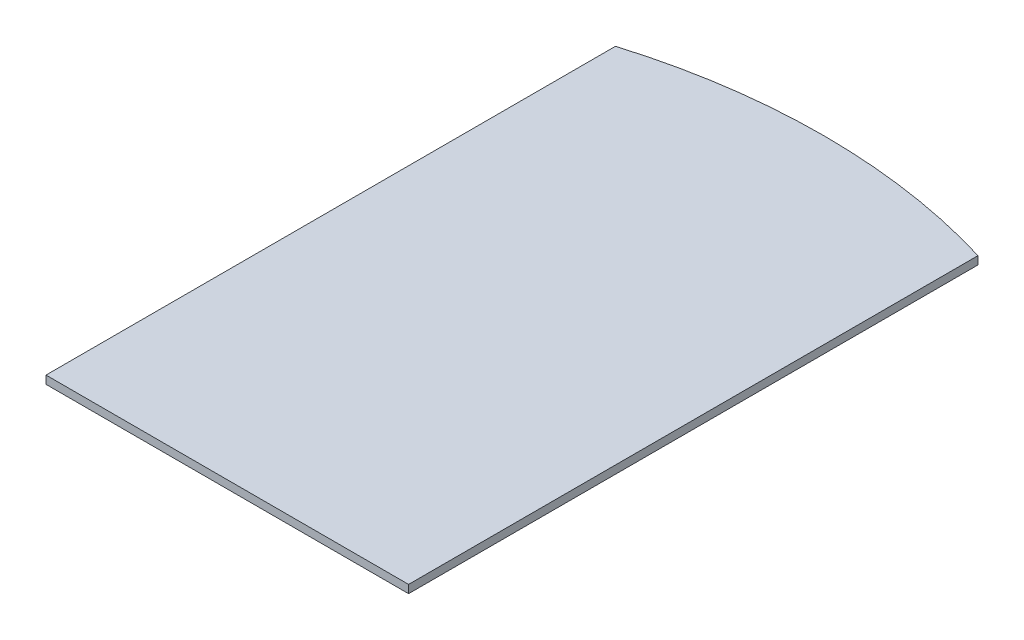
ISO-10303-21;
HEADER;
FILE_DESCRIPTION(('STEP AP214'),'2;1');
FILE_NAME('part.step','',(''),(''),'','','');
FILE_SCHEMA(('AUTOMOTIVE_DESIGN { 1 0 10303 214 1 1 1 1 }'));
ENDSEC;
DATA;
#1=APPLICATION_CONTEXT('core data for automotive mechanical design processes');
#2=APPLICATION_PROTOCOL_DEFINITION('international standard','automotive_design',2000,#1);
#3=PRODUCT_CONTEXT('',#1,'mechanical');
#4=PRODUCT('Part','Part','',(#3));
#5=PRODUCT_RELATED_PRODUCT_CATEGORY('part','',(#4));
#6=PRODUCT_DEFINITION_FORMATION('','',#4);
#7=PRODUCT_DEFINITION_CONTEXT('part definition',#1,'design');
#8=PRODUCT_DEFINITION('design','',#6,#7);
#9=PRODUCT_DEFINITION_SHAPE('','',#8);
#10=(LENGTH_UNIT() NAMED_UNIT(*) SI_UNIT(.MILLI.,.METRE.));
#11=(NAMED_UNIT(*) PLANE_ANGLE_UNIT() SI_UNIT($,.RADIAN.));
#12=(NAMED_UNIT(*) SI_UNIT($,.STERADIAN.) SOLID_ANGLE_UNIT());
#13=UNCERTAINTY_MEASURE_WITH_UNIT(LENGTH_MEASURE(1.E-05),#10,'distance_accuracy_value','');
#14=(GEOMETRIC_REPRESENTATION_CONTEXT(3) GLOBAL_UNCERTAINTY_ASSIGNED_CONTEXT((#13)) GLOBAL_UNIT_ASSIGNED_CONTEXT((#10,
#11,#12)) REPRESENTATION_CONTEXT('',''));
#15=CARTESIAN_POINT('',(0.,0.,0.));
#16=DIRECTION('',(0.,0.,1.));
#17=DIRECTION('',(1.,0.,0.));
#18=AXIS2_PLACEMENT_3D('',#15,#16,#17);
#19=CARTESIAN_POINT('',(225.,-10.,370.));
#20=DIRECTION('',(1.,0.,0.));
#21=DIRECTION('',(0.,0.,-1.));
#22=AXIS2_PLACEMENT_3D('',#19,#20,#21);
#23=PLANE('',#22);
#24=DIRECTION('',(0.,0.,-1.));
#25=VECTOR('',#24,1.);
#26=CARTESIAN_POINT('',(225.,0.,370.));
#27=LINE('',#26,#25);
#28=CARTESIAN_POINT('',(225.,0.,370.));
#29=VERTEX_POINT('',#28);
#30=CARTESIAN_POINT('',(225.,0.,-336.709620752616));
#31=VERTEX_POINT('',#30);
#32=EDGE_CURVE('E100',#29,#31,#27,.T.);
#33=ORIENTED_EDGE('',*,*,#32,.F.);
#34=DIRECTION('',(0.,1.,0.));
#35=VECTOR('',#34,1.);
#36=CARTESIAN_POINT('',(225.,-10.,370.));
#37=LINE('',#36,#35);
#38=CARTESIAN_POINT('',(225.,-10.,370.));
#39=VERTEX_POINT('',#38);
#40=EDGE_CURVE('E11',#39,#29,#37,.T.);
#41=ORIENTED_EDGE('',*,*,#40,.F.);
#42=DIRECTION('',(0.,0.,-1.));
#43=VECTOR('',#42,1.);
#44=CARTESIAN_POINT('',(225.,-10.,370.));
#45=LINE('',#44,#43);
#46=CARTESIAN_POINT('',(225.,-10.,-336.709620752616));
#47=VERTEX_POINT('',#46);
#48=EDGE_CURVE('E94',#39,#47,#45,.T.);
#49=ORIENTED_EDGE('',*,*,#48,.T.);
#50=DIRECTION('',(0.,1.,0.));
#51=VECTOR('',#50,1.);
#52=CARTESIAN_POINT('',(225.,-10.,-336.709620752616));
#53=LINE('',#52,#51);
#54=EDGE_CURVE('E39',#47,#31,#53,.T.);
#55=ORIENTED_EDGE('',*,*,#54,.T.);
#56=EDGE_LOOP('',(#33,#41,#49,#55));
#57=FACE_BOUND('',#56,.T.);
#58=ADVANCED_FACE('F36',(#57),#23,.T.);
#59=CARTESIAN_POINT('',(225.,-10.,370.));
#60=DIRECTION('',(0.,0.,1.));
#61=DIRECTION('',(1.,0.,0.));
#62=AXIS2_PLACEMENT_3D('',#59,#60,#61);
#63=PLANE('',#62);
#64=DIRECTION('',(1.,0.,0.));
#65=VECTOR('',#64,1.);
#66=CARTESIAN_POINT('',(225.,0.,370.));
#67=LINE('',#66,#65);
#68=CARTESIAN_POINT('',(-225.,0.,370.));
#69=VERTEX_POINT('',#68);
#70=EDGE_CURVE('E96',#69,#29,#67,.T.);
#71=ORIENTED_EDGE('',*,*,#70,.F.);
#72=DIRECTION('',(0.,1.,0.));
#73=VECTOR('',#72,1.);
#74=CARTESIAN_POINT('',(-225.,-10.,370.));
#75=LINE('',#74,#73);
#76=CARTESIAN_POINT('',(-225.,-10.,370.));
#77=VERTEX_POINT('',#76);
#78=EDGE_CURVE('E45',#77,#69,#75,.T.);
#79=ORIENTED_EDGE('',*,*,#78,.F.);
#80=DIRECTION('',(1.,0.,0.));
#81=VECTOR('',#80,1.);
#82=CARTESIAN_POINT('',(225.,-10.,370.));
#83=LINE('',#82,#81);
#84=EDGE_CURVE('E91',#77,#39,#83,.T.);
#85=ORIENTED_EDGE('',*,*,#84,.T.);
#86=ORIENTED_EDGE('',*,*,#40,.T.);
#87=EDGE_LOOP('',(#71,#79,#85,#86));
#88=FACE_BOUND('',#87,.T.);
#89=ADVANCED_FACE('F110',(#88),#63,.T.);
#90=CARTESIAN_POINT('',(-225.,-10.,370.));
#91=DIRECTION('',(-1.,0.,0.));
#92=DIRECTION('',(0.,0.,1.));
#93=AXIS2_PLACEMENT_3D('',#90,#91,#92);
#94=PLANE('',#93);
#95=DIRECTION('',(0.,0.,1.));
#96=VECTOR('',#95,1.);
#97=CARTESIAN_POINT('',(-225.,0.,370.));
#98=LINE('',#97,#96);
#99=CARTESIAN_POINT('',(-225.,0.,-336.709620752616));
#100=VERTEX_POINT('',#99);
#101=EDGE_CURVE('E86',#100,#69,#98,.T.);
#102=ORIENTED_EDGE('',*,*,#101,.F.);
#103=DIRECTION('',(0.,1.,0.));
#104=VECTOR('',#103,1.);
#105=CARTESIAN_POINT('',(-225.,-10.,-336.709620752616));
#106=LINE('',#105,#104);
#107=CARTESIAN_POINT('',(-225.,-10.,-336.709620752616));
#108=VERTEX_POINT('',#107);
#109=EDGE_CURVE('E81',#108,#100,#106,.T.);
#110=ORIENTED_EDGE('',*,*,#109,.F.);
#111=DIRECTION('',(0.,0.,1.));
#112=VECTOR('',#111,1.);
#113=CARTESIAN_POINT('',(-225.,-10.,370.));
#114=LINE('',#113,#112);
#115=EDGE_CURVE('E84',#108,#77,#114,.T.);
#116=ORIENTED_EDGE('',*,*,#115,.T.);
#117=ORIENTED_EDGE('',*,*,#78,.T.);
#118=EDGE_LOOP('',(#102,#110,#116,#117));
#119=FACE_BOUND('',#118,.T.);
#120=ADVANCED_FACE('F83',(#119),#94,.T.);
#121=CARTESIAN_POINT('',(0.,-10.,407.));
#122=DIRECTION('',(0.,1.,0.));
#123=DIRECTION('',(0.,0.,1.));
#124=AXIS2_PLACEMENT_3D('',#121,#122,#123);
#125=CYLINDRICAL_SURFACE('',#124,777.);
#126=CARTESIAN_POINT('',(0.,0.,407.));
#127=DIRECTION('',(0.,1.,0.));
#128=DIRECTION('',(0.,0.,1.));
#129=AXIS2_PLACEMENT_3D('',#126,#127,#128);
#130=CIRCLE('',#129,777.);
#131=EDGE_CURVE('E103',#31,#100,#130,.T.);
#132=ORIENTED_EDGE('',*,*,#131,.F.);
#133=ORIENTED_EDGE('',*,*,#54,.F.);
#134=CARTESIAN_POINT('',(0.,-10.,407.));
#135=DIRECTION('',(0.,1.,0.));
#136=DIRECTION('',(0.,0.,1.));
#137=AXIS2_PLACEMENT_3D('',#134,#135,#136);
#138=CIRCLE('',#137,777.);
#139=EDGE_CURVE('E90',#47,#108,#138,.T.);
#140=ORIENTED_EDGE('',*,*,#139,.T.);
#141=ORIENTED_EDGE('',*,*,#109,.T.);
#142=EDGE_LOOP('',(#132,#133,#140,#141));
#143=FACE_BOUND('',#142,.T.);
#144=ADVANCED_FACE('F93',(#143),#125,.T.);
#145=CARTESIAN_POINT('',(0.,-10.,407.));
#146=DIRECTION('',(0.,1.,0.));
#147=DIRECTION('',(0.,0.,1.));
#148=AXIS2_PLACEMENT_3D('',#145,#146,#147);
#149=PLANE('',#148);
#150=ORIENTED_EDGE('',*,*,#48,.F.);
#151=ORIENTED_EDGE('',*,*,#84,.F.);
#152=ORIENTED_EDGE('',*,*,#115,.F.);
#153=ORIENTED_EDGE('',*,*,#139,.F.);
#154=EDGE_LOOP('',(#150,#151,#152,#153));
#155=FACE_BOUND('',#154,.T.);
#156=ADVANCED_FACE('F89',(#155),#149,.F.);
#157=CARTESIAN_POINT('',(0.,0.,407.));
#158=DIRECTION('',(0.,1.,0.));
#159=DIRECTION('',(0.,0.,1.));
#160=AXIS2_PLACEMENT_3D('',#157,#158,#159);
#161=PLANE('',#160);
#162=ORIENTED_EDGE('',*,*,#32,.T.);
#163=ORIENTED_EDGE('',*,*,#131,.T.);
#164=ORIENTED_EDGE('',*,*,#101,.T.);
#165=ORIENTED_EDGE('',*,*,#70,.T.);
#166=EDGE_LOOP('',(#162,#163,#164,#165));
#167=FACE_BOUND('',#166,.T.);
#168=ADVANCED_FACE('F109',(#167),#161,.T.);
#169=CLOSED_SHELL('',(#58,#89,#120,#144,#156,#168));
#170=MANIFOLD_SOLID_BREP('B2',#169);
#171=ADVANCED_BREP_SHAPE_REPRESENTATION('',(#18,#170),#14);
#172=SHAPE_DEFINITION_REPRESENTATION(#9,#171);
ENDSEC;
END-ISO-10303-21;
